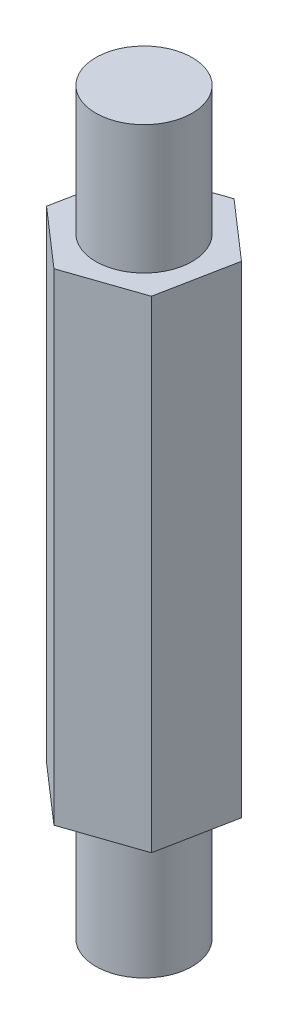
ISO-10303-21;
HEADER;
FILE_DESCRIPTION(('STEP AP214'),'2;1');
FILE_NAME('part.step','',(''),(''),'','','');
FILE_SCHEMA(('AUTOMOTIVE_DESIGN { 1 0 10303 214 1 1 1 1 }'));
ENDSEC;
DATA;
#1=APPLICATION_CONTEXT('core data for automotive mechanical design processes');
#2=APPLICATION_PROTOCOL_DEFINITION('international standard','automotive_design',2000,#1);
#3=PRODUCT_CONTEXT('',#1,'mechanical');
#4=PRODUCT('Part','Part','',(#3));
#5=PRODUCT_RELATED_PRODUCT_CATEGORY('part','',(#4));
#6=PRODUCT_DEFINITION_FORMATION('','',#4);
#7=PRODUCT_DEFINITION_CONTEXT('part definition',#1,'design');
#8=PRODUCT_DEFINITION('design','',#6,#7);
#9=PRODUCT_DEFINITION_SHAPE('','',#8);
#10=(LENGTH_UNIT() NAMED_UNIT(*) SI_UNIT(.MILLI.,.METRE.));
#11=(NAMED_UNIT(*) PLANE_ANGLE_UNIT() SI_UNIT($,.RADIAN.));
#12=(NAMED_UNIT(*) SI_UNIT($,.STERADIAN.) SOLID_ANGLE_UNIT());
#13=UNCERTAINTY_MEASURE_WITH_UNIT(LENGTH_MEASURE(1.E-05),#10,'distance_accuracy_value','');
#14=(GEOMETRIC_REPRESENTATION_CONTEXT(3) GLOBAL_UNCERTAINTY_ASSIGNED_CONTEXT((#13)) GLOBAL_UNIT_ASSIGNED_CONTEXT((#10,
#11,#12)) REPRESENTATION_CONTEXT('',''));
#15=CARTESIAN_POINT('',(0.,0.,0.));
#16=DIRECTION('',(0.,0.,1.));
#17=DIRECTION('',(1.,0.,0.));
#18=AXIS2_PLACEMENT_3D('',#15,#16,#17);
#19=CARTESIAN_POINT('',(-0.458907915457957,15.,2.34361851900916));
#20=DIRECTION('',(-0.324264068247391,0.,-0.945966603027639));
#21=DIRECTION('',(-0.945966603027639,0.,0.324264068247391));
#22=AXIS2_PLACEMENT_3D('',#19,#20,#21);
#23=PLANE('',#22);
#24=DIRECTION('',(0.945966603027639,0.,-0.324264068247391));
#25=VECTOR('',#24,1.);
#26=CARTESIAN_POINT('',(-0.458907915457957,0.,2.34361851900916));
#27=LINE('',#26,#25);
#28=CARTESIAN_POINT('',(-0.458907915457957,0.,2.34361851900916));
#29=VERTEX_POINT('',#28);
#30=CARTESIAN_POINT('',(1.80017921651262,0.,1.56923517228893));
#31=VERTEX_POINT('',#30);
#32=EDGE_CURVE('E131',#29,#31,#27,.T.);
#33=ORIENTED_EDGE('',*,*,#32,.T.);
#34=DIRECTION('',(0.,-1.,0.));
#35=VECTOR('',#34,1.);
#36=CARTESIAN_POINT('',(1.80017921651262,15.,1.56923517228893));
#37=LINE('',#36,#35);
#38=CARTESIAN_POINT('',(1.80017921651262,15.,1.56923517228893));
#39=VERTEX_POINT('',#38);
#40=EDGE_CURVE('E42',#39,#31,#37,.T.);
#41=ORIENTED_EDGE('',*,*,#40,.F.);
#42=DIRECTION('',(0.945966603027639,0.,-0.324264068247391));
#43=VECTOR('',#42,1.);
#44=CARTESIAN_POINT('',(-0.458907915457957,15.,2.34361851900916));
#45=LINE('',#44,#43);
#46=CARTESIAN_POINT('',(-0.458907915457957,15.,2.34361851900916));
#47=VERTEX_POINT('',#46);
#48=EDGE_CURVE('E148',#47,#39,#45,.T.);
#49=ORIENTED_EDGE('',*,*,#48,.F.);
#50=DIRECTION('',(0.,-1.,0.));
#51=VECTOR('',#50,1.);
#52=CARTESIAN_POINT('',(-0.458907915457957,15.,2.34361851900916));
#53=LINE('',#52,#51);
#54=EDGE_CURVE('E127',#47,#29,#53,.T.);
#55=ORIENTED_EDGE('',*,*,#54,.T.);
#56=EDGE_LOOP('',(#33,#41,#49,#55));
#57=FACE_BOUND('',#56,.T.);
#58=ADVANCED_FACE('F39',(#57),#23,.F.);
#59=CARTESIAN_POINT('',(1.80017921651262,15.,1.56923517228893));
#60=DIRECTION('',(-0.981363143477301,0.,-0.192162380877088));
#61=DIRECTION('',(-0.192162380877088,0.,0.981363143477301));
#62=AXIS2_PLACEMENT_3D('',#59,#60,#61);
#63=PLANE('',#62);
#64=DIRECTION('',(0.192162380877088,0.,-0.981363143477301));
#65=VECTOR('',#64,1.);
#66=CARTESIAN_POINT('',(1.80017921651262,0.,1.56923517228893));
#67=LINE('',#66,#65);
#68=CARTESIAN_POINT('',(2.25908713197057,0.,-0.774383346720227));
#69=VERTEX_POINT('',#68);
#70=EDGE_CURVE('E135',#31,#69,#67,.T.);
#71=ORIENTED_EDGE('',*,*,#70,.T.);
#72=DIRECTION('',(0.,-1.,0.));
#73=VECTOR('',#72,1.);
#74=CARTESIAN_POINT('',(2.25908713197057,15.,-0.774383346720227));
#75=LINE('',#74,#73);
#76=CARTESIAN_POINT('',(2.25908713197057,15.,-0.774383346720227));
#77=VERTEX_POINT('',#76);
#78=EDGE_CURVE('E154',#77,#69,#75,.T.);
#79=ORIENTED_EDGE('',*,*,#78,.F.);
#80=DIRECTION('',(0.192162380877088,0.,-0.981363143477301));
#81=VECTOR('',#80,1.);
#82=CARTESIAN_POINT('',(1.80017921651262,15.,1.56923517228893));
#83=LINE('',#82,#81);
#84=EDGE_CURVE('E96',#39,#77,#83,.T.);
#85=ORIENTED_EDGE('',*,*,#84,.F.);
#86=ORIENTED_EDGE('',*,*,#40,.T.);
#87=EDGE_LOOP('',(#71,#79,#85,#86));
#88=FACE_BOUND('',#87,.T.);
#89=ADVANCED_FACE('F208',(#88),#63,.F.);
#90=CARTESIAN_POINT('',(2.25908713197057,15.,-0.774383346720227));
#91=DIRECTION('',(-0.65709907522991,0.,0.753804222150551));
#92=DIRECTION('',(0.753804222150551,0.,0.65709907522991));
#93=AXIS2_PLACEMENT_3D('',#90,#91,#92);
#94=PLANE('',#93);
#95=DIRECTION('',(-0.753804222150551,0.,-0.65709907522991));
#96=VECTOR('',#95,1.);
#97=CARTESIAN_POINT('',(2.25908713197057,0.,-0.774383346720227));
#98=LINE('',#97,#96);
#99=CARTESIAN_POINT('',(0.458907915457957,0.,-2.34361851900916));
#100=VERTEX_POINT('',#99);
#101=EDGE_CURVE('E139',#69,#100,#98,.T.);
#102=ORIENTED_EDGE('',*,*,#101,.T.);
#103=DIRECTION('',(0.,-1.,0.));
#104=VECTOR('',#103,1.);
#105=CARTESIAN_POINT('',(0.458907915457957,15.,-2.34361851900916));
#106=LINE('',#105,#104);
#107=CARTESIAN_POINT('',(0.458907915457957,15.,-2.34361851900916));
#108=VERTEX_POINT('',#107);
#109=EDGE_CURVE('E120',#108,#100,#106,.T.);
#110=ORIENTED_EDGE('',*,*,#109,.F.);
#111=DIRECTION('',(-0.753804222150551,0.,-0.65709907522991));
#112=VECTOR('',#111,1.);
#113=CARTESIAN_POINT('',(2.25908713197057,15.,-0.774383346720227));
#114=LINE('',#113,#112);
#115=EDGE_CURVE('E109',#77,#108,#114,.T.);
#116=ORIENTED_EDGE('',*,*,#115,.F.);
#117=ORIENTED_EDGE('',*,*,#78,.T.);
#118=EDGE_LOOP('',(#102,#110,#116,#117));
#119=FACE_BOUND('',#118,.T.);
#120=ADVANCED_FACE('F212',(#119),#94,.F.);
#121=CARTESIAN_POINT('',(0.458907915457957,15.,-2.34361851900916));
#122=DIRECTION('',(0.324264068247391,0.,0.945966603027639));
#123=DIRECTION('',(0.94596660302764,0.,-0.324264068247391));
#124=AXIS2_PLACEMENT_3D('',#121,#122,#123);
#125=PLANE('',#124);
#126=DIRECTION('',(-0.945966603027639,0.,0.32426406824739));
#127=VECTOR('',#126,1.);
#128=CARTESIAN_POINT('',(0.458907915457957,0.,-2.34361851900916));
#129=LINE('',#128,#127);
#130=CARTESIAN_POINT('',(-1.80017921651262,0.,-1.56923517228893));
#131=VERTEX_POINT('',#130);
#132=EDGE_CURVE('E118',#100,#131,#129,.T.);
#133=ORIENTED_EDGE('',*,*,#132,.T.);
#134=DIRECTION('',(0.,-1.,0.));
#135=VECTOR('',#134,1.);
#136=CARTESIAN_POINT('',(-1.80017921651262,15.,-1.56923517228893));
#137=LINE('',#136,#135);
#138=CARTESIAN_POINT('',(-1.80017921651262,15.,-1.56923517228893));
#139=VERTEX_POINT('',#138);
#140=EDGE_CURVE('E115',#139,#131,#137,.T.);
#141=ORIENTED_EDGE('',*,*,#140,.F.);
#142=DIRECTION('',(-0.945966603027639,0.,0.32426406824739));
#143=VECTOR('',#142,1.);
#144=CARTESIAN_POINT('',(0.458907915457957,15.,-2.34361851900916));
#145=LINE('',#144,#143);
#146=EDGE_CURVE('E103',#108,#139,#145,.T.);
#147=ORIENTED_EDGE('',*,*,#146,.F.);
#148=ORIENTED_EDGE('',*,*,#109,.T.);
#149=EDGE_LOOP('',(#133,#141,#147,#148));
#150=FACE_BOUND('',#149,.T.);
#151=ADVANCED_FACE('F116',(#150),#125,.F.);
#152=CARTESIAN_POINT('',(-1.80017921651262,15.,-1.56923517228893));
#153=DIRECTION('',(0.9813631434773,0.,0.192162380877088));
#154=DIRECTION('',(0.192162380877089,0.,-0.981363143477301));
#155=AXIS2_PLACEMENT_3D('',#152,#153,#154);
#156=PLANE('',#155);
#157=DIRECTION('',(-0.192162380877088,0.,0.9813631434773));
#158=VECTOR('',#157,1.);
#159=CARTESIAN_POINT('',(-1.80017921651262,0.,-1.56923517228893));
#160=LINE('',#159,#158);
#161=CARTESIAN_POINT('',(-2.25908713197057,0.,0.774383346720227));
#162=VERTEX_POINT('',#161);
#163=EDGE_CURVE('E81',#131,#162,#160,.T.);
#164=ORIENTED_EDGE('',*,*,#163,.T.);
#165=DIRECTION('',(0.,-1.,0.));
#166=VECTOR('',#165,1.);
#167=CARTESIAN_POINT('',(-2.25908713197057,15.,0.774383346720227));
#168=LINE('',#167,#166);
#169=CARTESIAN_POINT('',(-2.25908713197057,15.,0.774383346720227));
#170=VERTEX_POINT('',#169);
#171=EDGE_CURVE('E121',#170,#162,#168,.T.);
#172=ORIENTED_EDGE('',*,*,#171,.F.);
#173=DIRECTION('',(-0.192162380877088,0.,0.9813631434773));
#174=VECTOR('',#173,1.);
#175=CARTESIAN_POINT('',(-1.80017921651262,15.,-1.56923517228893));
#176=LINE('',#175,#174);
#177=EDGE_CURVE('E107',#139,#170,#176,.T.);
#178=ORIENTED_EDGE('',*,*,#177,.F.);
#179=ORIENTED_EDGE('',*,*,#140,.T.);
#180=EDGE_LOOP('',(#164,#172,#178,#179));
#181=FACE_BOUND('',#180,.T.);
#182=ADVANCED_FACE('F123',(#181),#156,.F.);
#183=CARTESIAN_POINT('',(-2.25908713197057,15.,0.774383346720227));
#184=DIRECTION('',(0.65709907522991,0.,-0.753804222150551));
#185=DIRECTION('',(-0.753804222150551,0.,-0.65709907522991));
#186=AXIS2_PLACEMENT_3D('',#183,#184,#185);
#187=PLANE('',#186);
#188=DIRECTION('',(0.753804222150551,0.,0.65709907522991));
#189=VECTOR('',#188,1.);
#190=CARTESIAN_POINT('',(-2.25908713197057,0.,0.774383346720227));
#191=LINE('',#190,#189);
#192=EDGE_CURVE('E87',#162,#29,#191,.T.);
#193=ORIENTED_EDGE('',*,*,#192,.T.);
#194=ORIENTED_EDGE('',*,*,#54,.F.);
#195=DIRECTION('',(0.753804222150551,0.,0.65709907522991));
#196=VECTOR('',#195,1.);
#197=CARTESIAN_POINT('',(-2.25908713197057,15.,0.774383346720227));
#198=LINE('',#197,#196);
#199=EDGE_CURVE('E58',#170,#47,#198,.T.);
#200=ORIENTED_EDGE('',*,*,#199,.F.);
#201=ORIENTED_EDGE('',*,*,#171,.T.);
#202=EDGE_LOOP('',(#193,#194,#200,#201));
#203=FACE_BOUND('',#202,.T.);
#204=ADVANCED_FACE('F197',(#203),#187,.F.);
#205=CARTESIAN_POINT('',(0.,15.,0.));
#206=DIRECTION('',(0.,1.,0.));
#207=DIRECTION('',(0.,0.,1.));
#208=AXIS2_PLACEMENT_3D('',#205,#206,#207);
#209=PLANE('',#208);
#210=CARTESIAN_POINT('',(0.,15.,0.));
#211=DIRECTION('',(0.,1.,0.));
#212=DIRECTION('',(0.,0.,1.));
#213=AXIS2_PLACEMENT_3D('',#210,#211,#212);
#214=CIRCLE('',#213,1.5);
#215=CARTESIAN_POINT('',(0.,15.,1.5));
#216=VERTEX_POINT('',#215);
#217=EDGE_CURVE('E49',#216,#216,#214,.T.);
#218=ORIENTED_EDGE('',*,*,#217,.F.);
#219=EDGE_LOOP('',(#218));
#220=FACE_BOUND('',#219,.T.);
#221=ORIENTED_EDGE('',*,*,#48,.T.);
#222=ORIENTED_EDGE('',*,*,#84,.T.);
#223=ORIENTED_EDGE('',*,*,#115,.T.);
#224=ORIENTED_EDGE('',*,*,#146,.T.);
#225=ORIENTED_EDGE('',*,*,#177,.T.);
#226=ORIENTED_EDGE('',*,*,#199,.T.);
#227=EDGE_LOOP('',(#221,#222,#223,#224,#225,#226));
#228=FACE_BOUND('',#227,.T.);
#229=ADVANCED_FACE('F105',(#220,#228),#209,.T.);
#230=CARTESIAN_POINT('',(0.,0.,0.));
#231=DIRECTION('',(0.,1.,0.));
#232=DIRECTION('',(0.,0.,1.));
#233=AXIS2_PLACEMENT_3D('',#230,#231,#232);
#234=PLANE('',#233);
#235=CARTESIAN_POINT('',(0.,0.,0.));
#236=DIRECTION('',(0.,-1.,0.));
#237=DIRECTION('',(0.,0.,-1.));
#238=AXIS2_PLACEMENT_3D('',#235,#236,#237);
#239=CIRCLE('',#238,1.5);
#240=CARTESIAN_POINT('',(0.,0.,-1.5));
#241=VERTEX_POINT('',#240);
#242=EDGE_CURVE('E11',#241,#241,#239,.T.);
#243=ORIENTED_EDGE('',*,*,#242,.F.);
#244=EDGE_LOOP('',(#243));
#245=FACE_BOUND('',#244,.T.);
#246=ORIENTED_EDGE('',*,*,#32,.F.);
#247=ORIENTED_EDGE('',*,*,#192,.F.);
#248=ORIENTED_EDGE('',*,*,#163,.F.);
#249=ORIENTED_EDGE('',*,*,#132,.F.);
#250=ORIENTED_EDGE('',*,*,#101,.F.);
#251=ORIENTED_EDGE('',*,*,#70,.F.);
#252=EDGE_LOOP('',(#246,#247,#248,#249,#250,#251));
#253=FACE_BOUND('',#252,.T.);
#254=ADVANCED_FACE('F189',(#245,#253),#234,.F.);
#255=CARTESIAN_POINT('',(0.,19.,0.));
#256=DIRECTION('',(0.,-1.,0.));
#257=DIRECTION('',(0.,0.,-1.));
#258=AXIS2_PLACEMENT_3D('',#255,#256,#257);
#259=CYLINDRICAL_SURFACE('',#258,1.5);
#260=CARTESIAN_POINT('',(0.,19.,0.));
#261=DIRECTION('',(0.,1.,0.));
#262=DIRECTION('',(0.,0.,1.));
#263=AXIS2_PLACEMENT_3D('',#260,#261,#262);
#264=CIRCLE('',#263,1.5);
#265=CARTESIAN_POINT('',(0.,19.,1.5));
#266=VERTEX_POINT('',#265);
#267=EDGE_CURVE('E136',#266,#266,#264,.T.);
#268=ORIENTED_EDGE('',*,*,#267,.F.);
#269=EDGE_LOOP('',(#268));
#270=FACE_BOUND('',#269,.T.);
#271=ORIENTED_EDGE('',*,*,#217,.T.);
#272=EDGE_LOOP('',(#271));
#273=FACE_BOUND('',#272,.T.);
#274=ADVANCED_FACE('F192',(#270,#273),#259,.T.);
#275=CARTESIAN_POINT('',(0.,19.,0.));
#276=DIRECTION('',(0.,1.,0.));
#277=DIRECTION('',(0.,0.,1.));
#278=AXIS2_PLACEMENT_3D('',#275,#276,#277);
#279=PLANE('',#278);
#280=ORIENTED_EDGE('',*,*,#267,.T.);
#281=EDGE_LOOP('',(#280));
#282=FACE_BOUND('',#281,.T.);
#283=ADVANCED_FACE('F185',(#282),#279,.T.);
#284=CARTESIAN_POINT('',(0.,-4.,0.));
#285=DIRECTION('',(0.,1.,0.));
#286=DIRECTION('',(0.,0.,1.));
#287=AXIS2_PLACEMENT_3D('',#284,#285,#286);
#288=CYLINDRICAL_SURFACE('',#287,1.5);
#289=CARTESIAN_POINT('',(0.,-4.,0.));
#290=DIRECTION('',(0.,-1.,0.));
#291=DIRECTION('',(0.,0.,-1.));
#292=AXIS2_PLACEMENT_3D('',#289,#290,#291);
#293=CIRCLE('',#292,1.5);
#294=CARTESIAN_POINT('',(0.,-4.,-1.5));
#295=VERTEX_POINT('',#294);
#296=EDGE_CURVE('E175',#295,#295,#293,.T.);
#297=ORIENTED_EDGE('',*,*,#296,.F.);
#298=EDGE_LOOP('',(#297));
#299=FACE_BOUND('',#298,.T.);
#300=ORIENTED_EDGE('',*,*,#242,.T.);
#301=EDGE_LOOP('',(#300));
#302=FACE_BOUND('',#301,.T.);
#303=ADVANCED_FACE('F182',(#299,#302),#288,.T.);
#304=CARTESIAN_POINT('',(0.,-4.,0.));
#305=DIRECTION('',(0.,-1.,0.));
#306=DIRECTION('',(0.,0.,-1.));
#307=AXIS2_PLACEMENT_3D('',#304,#305,#306);
#308=PLANE('',#307);
#309=ORIENTED_EDGE('',*,*,#296,.T.);
#310=EDGE_LOOP('',(#309));
#311=FACE_BOUND('',#310,.T.);
#312=ADVANCED_FACE('F180',(#311),#308,.T.);
#313=CLOSED_SHELL('',(#58,#89,#120,#151,#182,#204,#229,#254,#274,#283,#303,#312));
#314=MANIFOLD_SOLID_BREP('B2',#313);
#315=ADVANCED_BREP_SHAPE_REPRESENTATION('',(#18,#314),#14);
#316=SHAPE_DEFINITION_REPRESENTATION(#9,#315);
ENDSEC;
END-ISO-10303-21;
